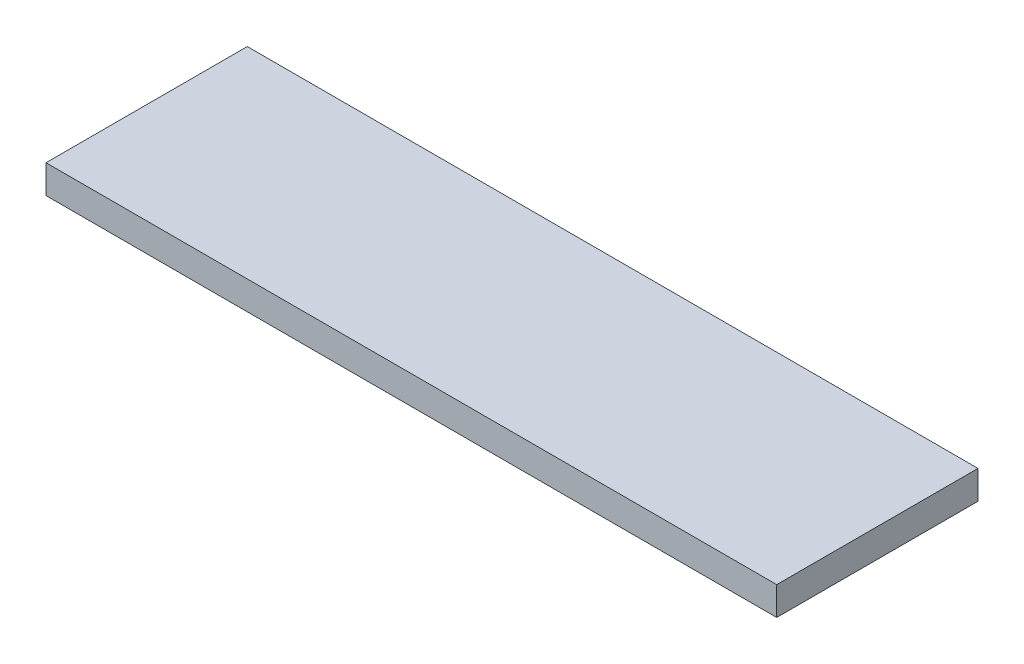
ISO-10303-21;
HEADER;
FILE_DESCRIPTION(('STEP AP214'),'2;1');
FILE_NAME('part.step','',(''),(''),'','','');
FILE_SCHEMA(('AUTOMOTIVE_DESIGN { 1 0 10303 214 1 1 1 1 }'));
ENDSEC;
DATA;
#1=APPLICATION_CONTEXT('core data for automotive mechanical design processes');
#2=APPLICATION_PROTOCOL_DEFINITION('international standard','automotive_design',2000,#1);
#3=PRODUCT_CONTEXT('',#1,'mechanical');
#4=PRODUCT('Part','Part','',(#3));
#5=PRODUCT_RELATED_PRODUCT_CATEGORY('part','',(#4));
#6=PRODUCT_DEFINITION_FORMATION('','',#4);
#7=PRODUCT_DEFINITION_CONTEXT('part definition',#1,'design');
#8=PRODUCT_DEFINITION('design','',#6,#7);
#9=PRODUCT_DEFINITION_SHAPE('','',#8);
#10=(LENGTH_UNIT() NAMED_UNIT(*) SI_UNIT(.MILLI.,.METRE.));
#11=(NAMED_UNIT(*) PLANE_ANGLE_UNIT() SI_UNIT($,.RADIAN.));
#12=(NAMED_UNIT(*) SI_UNIT($,.STERADIAN.) SOLID_ANGLE_UNIT());
#13=UNCERTAINTY_MEASURE_WITH_UNIT(LENGTH_MEASURE(1.E-05),#10,'distance_accuracy_value','');
#14=(GEOMETRIC_REPRESENTATION_CONTEXT(3) GLOBAL_UNCERTAINTY_ASSIGNED_CONTEXT((#13)) GLOBAL_UNIT_ASSIGNED_CONTEXT((#10,
#11,#12)) REPRESENTATION_CONTEXT('',''));
#15=CARTESIAN_POINT('',(0.,0.,0.));
#16=DIRECTION('',(0.,0.,1.));
#17=DIRECTION('',(1.,0.,0.));
#18=AXIS2_PLACEMENT_3D('',#15,#16,#17);
#19=CARTESIAN_POINT('',(38.5273775216138,3.,-14.7478386167147));
#20=DIRECTION('',(-1.,0.,0.));
#21=DIRECTION('',(0.,0.,1.));
#22=AXIS2_PLACEMENT_3D('',#19,#20,#21);
#23=PLANE('',#22);
#24=DIRECTION('',(0.,0.,-1.));
#25=VECTOR('',#24,1.);
#26=CARTESIAN_POINT('',(38.5273775216138,0.,-14.7478386167147));
#27=LINE('',#26,#25);
#28=CARTESIAN_POINT('',(38.5273775216138,0.,6.4621613832853));
#29=VERTEX_POINT('',#28);
#30=CARTESIAN_POINT('',(38.5273775216138,0.,-14.7478386167147));
#31=VERTEX_POINT('',#30);
#32=EDGE_CURVE('E98',#29,#31,#27,.T.);
#33=ORIENTED_EDGE('',*,*,#32,.T.);
#34=DIRECTION('',(0.,-1.,0.));
#35=VECTOR('',#34,1.);
#36=CARTESIAN_POINT('',(38.5273775216138,3.,-14.7478386167147));
#37=LINE('',#36,#35);
#38=CARTESIAN_POINT('',(38.5273775216138,3.,-14.7478386167147));
#39=VERTEX_POINT('',#38);
#40=EDGE_CURVE('E11',#39,#31,#37,.T.);
#41=ORIENTED_EDGE('',*,*,#40,.F.);
#42=DIRECTION('',(0.,0.,-1.));
#43=VECTOR('',#42,1.);
#44=CARTESIAN_POINT('',(38.5273775216138,3.,-14.7478386167147));
#45=LINE('',#44,#43);
#46=CARTESIAN_POINT('',(38.5273775216138,3.,6.4621613832853));
#47=VERTEX_POINT('',#46);
#48=EDGE_CURVE('E85',#47,#39,#45,.T.);
#49=ORIENTED_EDGE('',*,*,#48,.F.);
#50=DIRECTION('',(0.,-1.,0.));
#51=VECTOR('',#50,1.);
#52=CARTESIAN_POINT('',(38.5273775216138,3.,6.4621613832853));
#53=LINE('',#52,#51);
#54=EDGE_CURVE('E94',#47,#29,#53,.T.);
#55=ORIENTED_EDGE('',*,*,#54,.T.);
#56=EDGE_LOOP('',(#33,#41,#49,#55));
#57=FACE_BOUND('',#56,.T.);
#58=ADVANCED_FACE('F35',(#57),#23,.F.);
#59=CARTESIAN_POINT('',(-38.4726224783862,3.,-14.7478386167147));
#60=DIRECTION('',(0.,0.,1.));
#61=DIRECTION('',(1.,0.,0.));
#62=AXIS2_PLACEMENT_3D('',#59,#60,#61);
#63=PLANE('',#62);
#64=DIRECTION('',(-1.,0.,0.));
#65=VECTOR('',#64,1.);
#66=CARTESIAN_POINT('',(-38.4726224783862,0.,-14.7478386167147));
#67=LINE('',#66,#65);
#68=CARTESIAN_POINT('',(-38.4726224783862,0.,-14.7478386167147));
#69=VERTEX_POINT('',#68);
#70=EDGE_CURVE('E90',#31,#69,#67,.T.);
#71=ORIENTED_EDGE('',*,*,#70,.T.);
#72=DIRECTION('',(0.,-1.,0.));
#73=VECTOR('',#72,1.);
#74=CARTESIAN_POINT('',(-38.4726224783862,3.,-14.7478386167147));
#75=LINE('',#74,#73);
#76=CARTESIAN_POINT('',(-38.4726224783862,3.,-14.7478386167147));
#77=VERTEX_POINT('',#76);
#78=EDGE_CURVE('E43',#77,#69,#75,.T.);
#79=ORIENTED_EDGE('',*,*,#78,.F.);
#80=DIRECTION('',(-1.,0.,0.));
#81=VECTOR('',#80,1.);
#82=CARTESIAN_POINT('',(-30.4726224783862,3.,-14.7478386167147));
#83=LINE('',#82,#81);
#84=EDGE_CURVE('E80',#39,#77,#83,.T.);
#85=ORIENTED_EDGE('',*,*,#84,.F.);
#86=ORIENTED_EDGE('',*,*,#40,.T.);
#87=EDGE_LOOP('',(#71,#79,#85,#86));
#88=FACE_BOUND('',#87,.T.);
#89=ADVANCED_FACE('F89',(#88),#63,.F.);
#90=CARTESIAN_POINT('',(-38.4726224783862,3.,-6.7478386167147));
#91=DIRECTION('',(1.,0.,0.));
#92=DIRECTION('',(0.,0.,-1.));
#93=AXIS2_PLACEMENT_3D('',#90,#91,#92);
#94=PLANE('',#93);
#95=DIRECTION('',(0.,0.,1.));
#96=VECTOR('',#95,1.);
#97=CARTESIAN_POINT('',(-38.4726224783862,0.,-6.7478386167147));
#98=LINE('',#97,#96);
#99=CARTESIAN_POINT('',(-38.4726224783862,0.,6.4621613832853));
#100=VERTEX_POINT('',#99);
#101=EDGE_CURVE('E67',#69,#100,#98,.T.);
#102=ORIENTED_EDGE('',*,*,#101,.T.);
#103=DIRECTION('',(0.,-1.,0.));
#104=VECTOR('',#103,1.);
#105=CARTESIAN_POINT('',(-38.4726224783862,3.,6.4621613832853));
#106=LINE('',#105,#104);
#107=CARTESIAN_POINT('',(-38.4726224783862,3.,6.4621613832853));
#108=VERTEX_POINT('',#107);
#109=EDGE_CURVE('E91',#108,#100,#106,.T.);
#110=ORIENTED_EDGE('',*,*,#109,.F.);
#111=DIRECTION('',(0.,0.,1.));
#112=VECTOR('',#111,1.);
#113=CARTESIAN_POINT('',(-38.4726224783862,3.,-6.7478386167147));
#114=LINE('',#113,#112);
#115=EDGE_CURVE('E83',#77,#108,#114,.T.);
#116=ORIENTED_EDGE('',*,*,#115,.F.);
#117=ORIENTED_EDGE('',*,*,#78,.T.);
#118=EDGE_LOOP('',(#102,#110,#116,#117));
#119=FACE_BOUND('',#118,.T.);
#120=ADVANCED_FACE('F92',(#119),#94,.F.);
#121=CARTESIAN_POINT('',(-38.4726224783862,3.,6.4621613832853));
#122=DIRECTION('',(0.,0.,-1.));
#123=DIRECTION('',(-1.,0.,0.));
#124=AXIS2_PLACEMENT_3D('',#121,#122,#123);
#125=PLANE('',#124);
#126=DIRECTION('',(1.,0.,0.));
#127=VECTOR('',#126,1.);
#128=CARTESIAN_POINT('',(-38.4726224783862,0.,6.4621613832853));
#129=LINE('',#128,#127);
#130=EDGE_CURVE('E73',#100,#29,#129,.T.);
#131=ORIENTED_EDGE('',*,*,#130,.T.);
#132=ORIENTED_EDGE('',*,*,#54,.F.);
#133=DIRECTION('',(1.,0.,0.));
#134=VECTOR('',#133,1.);
#135=CARTESIAN_POINT('',(-38.4726224783862,3.,6.4621613832853));
#136=LINE('',#135,#134);
#137=EDGE_CURVE('E51',#108,#47,#136,.T.);
#138=ORIENTED_EDGE('',*,*,#137,.F.);
#139=ORIENTED_EDGE('',*,*,#109,.T.);
#140=EDGE_LOOP('',(#131,#132,#138,#139));
#141=FACE_BOUND('',#140,.T.);
#142=ADVANCED_FACE('F105',(#141),#125,.F.);
#143=CARTESIAN_POINT('',(0.,3.,0.));
#144=DIRECTION('',(0.,1.,0.));
#145=DIRECTION('',(0.,0.,1.));
#146=AXIS2_PLACEMENT_3D('',#143,#144,#145);
#147=PLANE('',#146);
#148=ORIENTED_EDGE('',*,*,#48,.T.);
#149=ORIENTED_EDGE('',*,*,#84,.T.);
#150=ORIENTED_EDGE('',*,*,#115,.T.);
#151=ORIENTED_EDGE('',*,*,#137,.T.);
#152=EDGE_LOOP('',(#148,#149,#150,#151));
#153=FACE_BOUND('',#152,.T.);
#154=ADVANCED_FACE('F81',(#153),#147,.T.);
#155=CARTESIAN_POINT('',(0.,0.,0.));
#156=DIRECTION('',(0.,1.,0.));
#157=DIRECTION('',(0.,0.,1.));
#158=AXIS2_PLACEMENT_3D('',#155,#156,#157);
#159=PLANE('',#158);
#160=ORIENTED_EDGE('',*,*,#32,.F.);
#161=ORIENTED_EDGE('',*,*,#130,.F.);
#162=ORIENTED_EDGE('',*,*,#101,.F.);
#163=ORIENTED_EDGE('',*,*,#70,.F.);
#164=EDGE_LOOP('',(#160,#161,#162,#163));
#165=FACE_BOUND('',#164,.T.);
#166=ADVANCED_FACE('F108',(#165),#159,.F.);
#167=CLOSED_SHELL('',(#58,#89,#120,#142,#154,#166));
#168=MANIFOLD_SOLID_BREP('B2',#167);
#169=ADVANCED_BREP_SHAPE_REPRESENTATION('',(#18,#168),#14);
#170=SHAPE_DEFINITION_REPRESENTATION(#9,#169);
ENDSEC;
END-ISO-10303-21;
